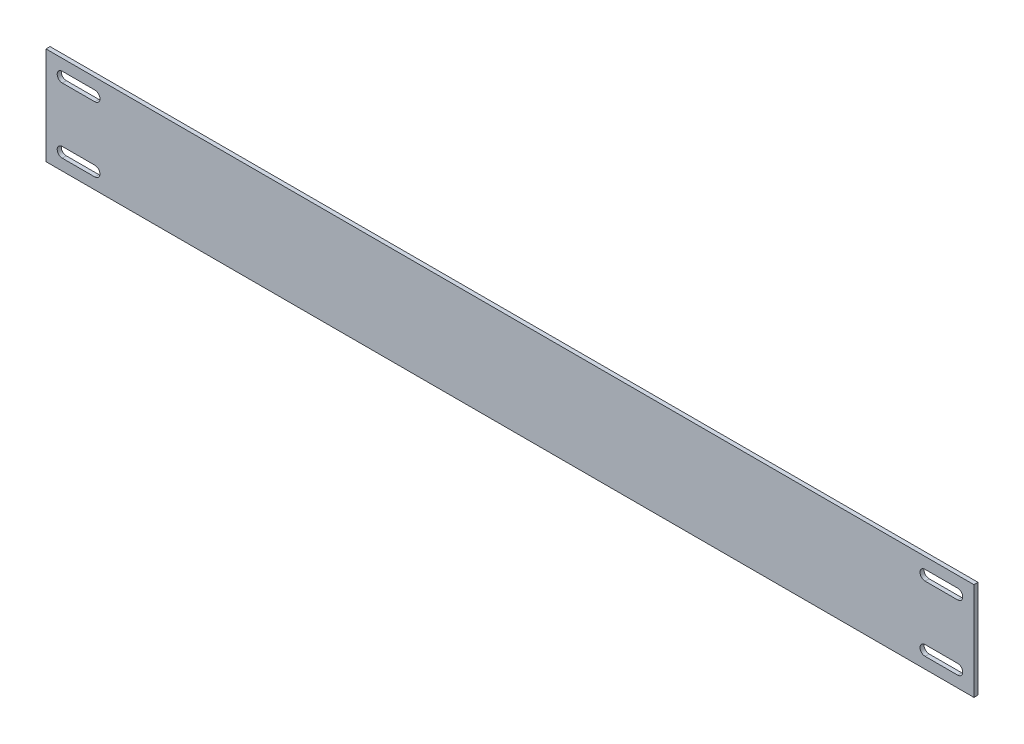
ISO-10303-21;
HEADER;
FILE_DESCRIPTION(('STEP AP214'),'2;1');
FILE_NAME('part.step','',(''),(''),'','','');
FILE_SCHEMA(('AUTOMOTIVE_DESIGN { 1 0 10303 214 1 1 1 1 }'));
ENDSEC;
DATA;
#1=APPLICATION_CONTEXT('core data for automotive mechanical design processes');
#2=APPLICATION_PROTOCOL_DEFINITION('international standard','automotive_design',2000,#1);
#3=PRODUCT_CONTEXT('',#1,'mechanical');
#4=PRODUCT('Part','Part','',(#3));
#5=PRODUCT_RELATED_PRODUCT_CATEGORY('part','',(#4));
#6=PRODUCT_DEFINITION_FORMATION('','',#4);
#7=PRODUCT_DEFINITION_CONTEXT('part definition',#1,'design');
#8=PRODUCT_DEFINITION('design','',#6,#7);
#9=PRODUCT_DEFINITION_SHAPE('','',#8);
#10=(LENGTH_UNIT() NAMED_UNIT(*) SI_UNIT(.MILLI.,.METRE.));
#11=(NAMED_UNIT(*) PLANE_ANGLE_UNIT() SI_UNIT($,.RADIAN.));
#12=(NAMED_UNIT(*) SI_UNIT($,.STERADIAN.) SOLID_ANGLE_UNIT());
#13=UNCERTAINTY_MEASURE_WITH_UNIT(LENGTH_MEASURE(1.E-05),#10,'distance_accuracy_value','');
#14=(GEOMETRIC_REPRESENTATION_CONTEXT(3) GLOBAL_UNCERTAINTY_ASSIGNED_CONTEXT((#13)) GLOBAL_UNIT_ASSIGNED_CONTEXT((#10,
#11,#12)) REPRESENTATION_CONTEXT('',''));
#15=CARTESIAN_POINT('',(0.,0.,0.));
#16=DIRECTION('',(0.,0.,1.));
#17=DIRECTION('',(1.,0.,0.));
#18=AXIS2_PLACEMENT_3D('',#15,#16,#17);
#19=CARTESIAN_POINT('',(0.,38.1,0.));
#20=DIRECTION('',(0.,0.,-1.));
#21=DIRECTION('',(-1.,0.,0.));
#22=AXIS2_PLACEMENT_3D('',#19,#20,#21);
#23=PLANE('',#22);
#24=CARTESIAN_POINT('',(342.9,6.35000000000005,0.));
#25=DIRECTION('',(0.,0.,-1.));
#26=DIRECTION('',(-1.,0.,0.));
#27=AXIS2_PLACEMENT_3D('',#24,#25,#26);
#28=CIRCLE('',#27,1.9843749999999);
#29=CARTESIAN_POINT('',(342.9,4.36562500000015,0.));
#30=VERTEX_POINT('',#29);
#31=CARTESIAN_POINT('',(342.9,8.33437499999994,0.));
#32=VERTEX_POINT('',#31);
#33=EDGE_CURVE('E232',#30,#32,#28,.T.);
#34=ORIENTED_EDGE('',*,*,#33,.T.);
#35=DIRECTION('',(1.,0.,0.));
#36=VECTOR('',#35,1.);
#37=CARTESIAN_POINT('',(0.,8.33437499999985,0.));
#38=LINE('',#37,#36);
#39=CARTESIAN_POINT('',(355.6,8.33437499999995,0.));
#40=VERTEX_POINT('',#39);
#41=EDGE_CURVE('E240',#32,#40,#38,.T.);
#42=ORIENTED_EDGE('',*,*,#41,.T.);
#43=CARTESIAN_POINT('',(355.6,6.35000000000005,0.));
#44=DIRECTION('',(0.,0.,-1.));
#45=DIRECTION('',(-1.,0.,0.));
#46=AXIS2_PLACEMENT_3D('',#43,#44,#45);
#47=CIRCLE('',#46,1.9843749999999);
#48=CARTESIAN_POINT('',(355.6,4.36562500000015,0.));
#49=VERTEX_POINT('',#48);
#50=EDGE_CURVE('E254',#40,#49,#47,.T.);
#51=ORIENTED_EDGE('',*,*,#50,.T.);
#52=DIRECTION('',(1.,0.,0.));
#53=VECTOR('',#52,1.);
#54=CARTESIAN_POINT('',(0.,4.36562500000015,0.));
#55=LINE('',#54,#53);
#56=EDGE_CURVE('E251',#30,#49,#55,.T.);
#57=ORIENTED_EDGE('',*,*,#56,.F.);
#58=EDGE_LOOP('',(#34,#42,#51,#57));
#59=FACE_BOUND('',#58,.T.);
#60=DIRECTION('',(1.,0.,0.));
#61=VECTOR('',#60,1.);
#62=CARTESIAN_POINT('',(0.,0.,0.));
#63=LINE('',#62,#61);
#64=CARTESIAN_POINT('',(0.,0.,0.));
#65=VERTEX_POINT('',#64);
#66=CARTESIAN_POINT('',(361.95,0.,0.));
#67=VERTEX_POINT('',#66);
#68=EDGE_CURVE('E335',#65,#67,#63,.T.);
#69=ORIENTED_EDGE('',*,*,#68,.T.);
#70=DIRECTION('',(0.,-1.,0.));
#71=VECTOR('',#70,1.);
#72=CARTESIAN_POINT('',(361.95,38.1,0.));
#73=LINE('',#72,#71);
#74=CARTESIAN_POINT('',(361.95,38.1,0.));
#75=VERTEX_POINT('',#74);
#76=EDGE_CURVE('E66',#75,#67,#73,.T.);
#77=ORIENTED_EDGE('',*,*,#76,.F.);
#78=DIRECTION('',(1.,0.,0.));
#79=VECTOR('',#78,1.);
#80=CARTESIAN_POINT('',(0.,38.1,0.));
#81=LINE('',#80,#79);
#82=CARTESIAN_POINT('',(0.,38.1,0.));
#83=VERTEX_POINT('',#82);
#84=EDGE_CURVE('E325',#83,#75,#81,.T.);
#85=ORIENTED_EDGE('',*,*,#84,.F.);
#86=DIRECTION('',(0.,-1.,0.));
#87=VECTOR('',#86,1.);
#88=CARTESIAN_POINT('',(0.,38.1,0.));
#89=LINE('',#88,#87);
#90=EDGE_CURVE('E12',#83,#65,#89,.T.);
#91=ORIENTED_EDGE('',*,*,#90,.T.);
#92=EDGE_LOOP('',(#69,#77,#85,#91));
#93=FACE_BOUND('',#92,.T.);
#94=CARTESIAN_POINT('',(19.05,31.75,0.));
#95=DIRECTION('',(0.,0.,-1.));
#96=DIRECTION('',(-1.,0.,0.));
#97=AXIS2_PLACEMENT_3D('',#94,#95,#96);
#98=CIRCLE('',#97,1.9843749999999);
#99=CARTESIAN_POINT('',(19.05,33.7343749999999,0.));
#100=VERTEX_POINT('',#99);
#101=CARTESIAN_POINT('',(19.05,29.7656250000001,0.));
#102=VERTEX_POINT('',#101);
#103=EDGE_CURVE('E300',#100,#102,#98,.T.);
#104=ORIENTED_EDGE('',*,*,#103,.T.);
#105=DIRECTION('',(-1.,0.,0.));
#106=VECTOR('',#105,1.);
#107=CARTESIAN_POINT('',(0.,29.7656250000001,0.));
#108=LINE('',#107,#106);
#109=CARTESIAN_POINT('',(6.35000000000003,29.7656250000001,0.));
#110=VERTEX_POINT('',#109);
#111=EDGE_CURVE('E290',#102,#110,#108,.T.);
#112=ORIENTED_EDGE('',*,*,#111,.T.);
#113=CARTESIAN_POINT('',(6.35000000000004,31.75,0.));
#114=DIRECTION('',(0.,0.,-1.));
#115=DIRECTION('',(-1.,0.,0.));
#116=AXIS2_PLACEMENT_3D('',#113,#114,#115);
#117=CIRCLE('',#116,1.9843749999999);
#118=CARTESIAN_POINT('',(6.35000000000002,33.7343749999999,0.));
#119=VERTEX_POINT('',#118);
#120=EDGE_CURVE('E293',#110,#119,#117,.T.);
#121=ORIENTED_EDGE('',*,*,#120,.T.);
#122=DIRECTION('',(-1.,0.,0.));
#123=VECTOR('',#122,1.);
#124=CARTESIAN_POINT('',(0.,33.7343749999999,0.));
#125=LINE('',#124,#123);
#126=EDGE_CURVE('E297',#100,#119,#125,.T.);
#127=ORIENTED_EDGE('',*,*,#126,.F.);
#128=EDGE_LOOP('',(#104,#112,#121,#127));
#129=FACE_BOUND('',#128,.T.);
#130=CARTESIAN_POINT('',(6.35000000000004,6.35000000000002,0.));
#131=DIRECTION('',(0.,0.,-1.));
#132=DIRECTION('',(-1.,0.,0.));
#133=AXIS2_PLACEMENT_3D('',#130,#131,#132);
#134=CIRCLE('',#133,1.9843749999999);
#135=CARTESIAN_POINT('',(6.35000000000002,8.33437499999992,0.));
#136=VERTEX_POINT('',#135);
#137=CARTESIAN_POINT('',(6.35000000000002,4.36562500000012,0.));
#138=VERTEX_POINT('',#137);
#139=EDGE_CURVE('E272',#136,#138,#134,.F.);
#140=ORIENTED_EDGE('',*,*,#139,.F.);
#141=DIRECTION('',(-1.,0.,0.));
#142=VECTOR('',#141,1.);
#143=CARTESIAN_POINT('',(0.,8.33437499999992,0.));
#144=LINE('',#143,#142);
#145=CARTESIAN_POINT('',(19.05,8.33437499999992,0.));
#146=VERTEX_POINT('',#145);
#147=EDGE_CURVE('E287',#146,#136,#144,.T.);
#148=ORIENTED_EDGE('',*,*,#147,.F.);
#149=CARTESIAN_POINT('',(19.05,6.35000000000002,0.));
#150=DIRECTION('',(0.,0.,-1.));
#151=DIRECTION('',(-1.,0.,0.));
#152=AXIS2_PLACEMENT_3D('',#149,#150,#151);
#153=CIRCLE('',#152,1.9843749999999);
#154=CARTESIAN_POINT('',(19.05,4.36562500000012,0.));
#155=VERTEX_POINT('',#154);
#156=EDGE_CURVE('E284',#155,#146,#153,.F.);
#157=ORIENTED_EDGE('',*,*,#156,.F.);
#158=DIRECTION('',(-1.,0.,0.));
#159=VECTOR('',#158,1.);
#160=CARTESIAN_POINT('',(0.,4.36562500000012,0.));
#161=LINE('',#160,#159);
#162=EDGE_CURVE('E262',#155,#138,#161,.T.);
#163=ORIENTED_EDGE('',*,*,#162,.T.);
#164=EDGE_LOOP('',(#140,#148,#157,#163));
#165=FACE_BOUND('',#164,.T.);
#166=CARTESIAN_POINT('',(342.9,31.75,0.));
#167=DIRECTION('',(0.,0.,-1.));
#168=DIRECTION('',(-1.,0.,0.));
#169=AXIS2_PLACEMENT_3D('',#166,#167,#168);
#170=CIRCLE('',#169,1.9843749999999);
#171=CARTESIAN_POINT('',(342.9,33.7343749999998,0.));
#172=VERTEX_POINT('',#171);
#173=CARTESIAN_POINT('',(342.9,29.7656250000001,0.));
#174=VERTEX_POINT('',#173);
#175=EDGE_CURVE('E223',#172,#174,#170,.F.);
#176=ORIENTED_EDGE('',*,*,#175,.F.);
#177=DIRECTION('',(1.,0.,0.));
#178=VECTOR('',#177,1.);
#179=CARTESIAN_POINT('',(0.,33.7343749999999,0.));
#180=LINE('',#179,#178);
#181=CARTESIAN_POINT('',(355.6,33.7343749999999,0.));
#182=VERTEX_POINT('',#181);
#183=EDGE_CURVE('E73',#172,#182,#180,.T.);
#184=ORIENTED_EDGE('',*,*,#183,.T.);
#185=CARTESIAN_POINT('',(355.6,31.75,0.));
#186=DIRECTION('',(0.,0.,-1.));
#187=DIRECTION('',(-1.,0.,0.));
#188=AXIS2_PLACEMENT_3D('',#185,#186,#187);
#189=CIRCLE('',#188,1.9843749999999);
#190=CARTESIAN_POINT('',(355.6,29.7656250000001,0.));
#191=VERTEX_POINT('',#190);
#192=EDGE_CURVE('E203',#191,#182,#189,.F.);
#193=ORIENTED_EDGE('',*,*,#192,.F.);
#194=DIRECTION('',(1.,0.,0.));
#195=VECTOR('',#194,1.);
#196=CARTESIAN_POINT('',(0.,29.7656250000002,0.));
#197=LINE('',#196,#195);
#198=EDGE_CURVE('E226',#174,#191,#197,.T.);
#199=ORIENTED_EDGE('',*,*,#198,.F.);
#200=EDGE_LOOP('',(#176,#184,#193,#199));
#201=FACE_BOUND('',#200,.T.);
#202=ADVANCED_FACE('F58',(#59,#93,#129,#165,#201),#23,.F.);
#203=CARTESIAN_POINT('',(0.,38.1,-1.5875));
#204=DIRECTION('',(0.,0.,1.));
#205=DIRECTION('',(1.,0.,0.));
#206=AXIS2_PLACEMENT_3D('',#203,#204,#205);
#207=PLANE('',#206);
#208=CARTESIAN_POINT('',(355.6,6.35000000000005,-1.5875));
#209=DIRECTION('',(0.,0.,-1.));
#210=DIRECTION('',(-1.,0.,0.));
#211=AXIS2_PLACEMENT_3D('',#208,#209,#210);
#212=CIRCLE('',#211,1.9843749999999);
#213=CARTESIAN_POINT('',(355.6,8.33437499999995,-1.5875));
#214=VERTEX_POINT('',#213);
#215=CARTESIAN_POINT('',(355.6,4.36562500000015,-1.5875));
#216=VERTEX_POINT('',#215);
#217=EDGE_CURVE('E243',#214,#216,#212,.T.);
#218=ORIENTED_EDGE('',*,*,#217,.F.);
#219=DIRECTION('',(1.,0.,0.));
#220=VECTOR('',#219,1.);
#221=CARTESIAN_POINT('',(0.,8.33437499999985,-1.5875));
#222=LINE('',#221,#220);
#223=CARTESIAN_POINT('',(342.9,8.33437499999994,-1.5875));
#224=VERTEX_POINT('',#223);
#225=EDGE_CURVE('E246',#224,#214,#222,.T.);
#226=ORIENTED_EDGE('',*,*,#225,.F.);
#227=CARTESIAN_POINT('',(342.9,6.35000000000005,-1.5875));
#228=DIRECTION('',(0.,0.,-1.));
#229=DIRECTION('',(-1.,0.,0.));
#230=AXIS2_PLACEMENT_3D('',#227,#228,#229);
#231=CIRCLE('',#230,1.9843749999999);
#232=CARTESIAN_POINT('',(342.9,4.36562500000015,-1.5875));
#233=VERTEX_POINT('',#232);
#234=EDGE_CURVE('E236',#233,#224,#231,.T.);
#235=ORIENTED_EDGE('',*,*,#234,.F.);
#236=DIRECTION('',(1.,0.,0.));
#237=VECTOR('',#236,1.);
#238=CARTESIAN_POINT('',(0.,4.36562500000015,-1.5875));
#239=LINE('',#238,#237);
#240=EDGE_CURVE('E239',#233,#216,#239,.T.);
#241=ORIENTED_EDGE('',*,*,#240,.T.);
#242=EDGE_LOOP('',(#218,#226,#235,#241));
#243=FACE_BOUND('',#242,.T.);
#244=DIRECTION('',(-1.,0.,0.));
#245=VECTOR('',#244,1.);
#246=CARTESIAN_POINT('',(0.,0.,-1.5875));
#247=LINE('',#246,#245);
#248=CARTESIAN_POINT('',(361.95,0.,-1.5875));
#249=VERTEX_POINT('',#248);
#250=CARTESIAN_POINT('',(0.,0.,-1.5875));
#251=VERTEX_POINT('',#250);
#252=EDGE_CURVE('E326',#249,#251,#247,.T.);
#253=ORIENTED_EDGE('',*,*,#252,.T.);
#254=DIRECTION('',(0.,-1.,0.));
#255=VECTOR('',#254,1.);
#256=CARTESIAN_POINT('',(0.,38.1,-1.5875));
#257=LINE('',#256,#255);
#258=CARTESIAN_POINT('',(0.,38.1,-1.5875));
#259=VERTEX_POINT('',#258);
#260=EDGE_CURVE('E332',#259,#251,#257,.T.);
#261=ORIENTED_EDGE('',*,*,#260,.F.);
#262=DIRECTION('',(-1.,0.,0.));
#263=VECTOR('',#262,1.);
#264=CARTESIAN_POINT('',(361.95,38.1,-1.5875));
#265=LINE('',#264,#263);
#266=CARTESIAN_POINT('',(361.95,38.1,-1.5875));
#267=VERTEX_POINT('',#266);
#268=EDGE_CURVE('E330',#267,#259,#265,.T.);
#269=ORIENTED_EDGE('',*,*,#268,.F.);
#270=DIRECTION('',(0.,-1.,0.));
#271=VECTOR('',#270,1.);
#272=CARTESIAN_POINT('',(361.95,38.1,-1.5875));
#273=LINE('',#272,#271);
#274=EDGE_CURVE('E343',#267,#249,#273,.T.);
#275=ORIENTED_EDGE('',*,*,#274,.T.);
#276=EDGE_LOOP('',(#253,#261,#269,#275));
#277=FACE_BOUND('',#276,.T.);
#278=CARTESIAN_POINT('',(6.35000000000004,31.75,-1.5875));
#279=DIRECTION('',(0.,0.,-1.));
#280=DIRECTION('',(-1.,0.,0.));
#281=AXIS2_PLACEMENT_3D('',#278,#279,#280);
#282=CIRCLE('',#281,1.9843749999999);
#283=CARTESIAN_POINT('',(6.35000000000003,29.7656250000001,-1.5875));
#284=VERTEX_POINT('',#283);
#285=CARTESIAN_POINT('',(6.35000000000002,33.7343749999999,-1.5875));
#286=VERTEX_POINT('',#285);
#287=EDGE_CURVE('E305',#284,#286,#282,.T.);
#288=ORIENTED_EDGE('',*,*,#287,.F.);
#289=DIRECTION('',(-1.,0.,0.));
#290=VECTOR('',#289,1.);
#291=CARTESIAN_POINT('',(0.,29.7656250000001,-1.5875));
#292=LINE('',#291,#290);
#293=CARTESIAN_POINT('',(19.05,29.7656250000001,-1.5875));
#294=VERTEX_POINT('',#293);
#295=EDGE_CURVE('E281',#294,#284,#292,.T.);
#296=ORIENTED_EDGE('',*,*,#295,.F.);
#297=CARTESIAN_POINT('',(19.05,31.75,-1.5875));
#298=DIRECTION('',(0.,0.,-1.));
#299=DIRECTION('',(-1.,0.,0.));
#300=AXIS2_PLACEMENT_3D('',#297,#298,#299);
#301=CIRCLE('',#300,1.9843749999999);
#302=CARTESIAN_POINT('',(19.05,33.7343749999999,-1.5875));
#303=VERTEX_POINT('',#302);
#304=EDGE_CURVE('E294',#303,#294,#301,.T.);
#305=ORIENTED_EDGE('',*,*,#304,.F.);
#306=DIRECTION('',(-1.,0.,0.));
#307=VECTOR('',#306,1.);
#308=CARTESIAN_POINT('',(0.,33.7343749999999,-1.5875));
#309=LINE('',#308,#307);
#310=EDGE_CURVE('E308',#303,#286,#309,.T.);
#311=ORIENTED_EDGE('',*,*,#310,.T.);
#312=EDGE_LOOP('',(#288,#296,#305,#311));
#313=FACE_BOUND('',#312,.T.);
#314=CARTESIAN_POINT('',(6.35000000000004,6.35000000000002,-1.5875));
#315=DIRECTION('',(0.,0.,-1.));
#316=DIRECTION('',(-1.,0.,0.));
#317=AXIS2_PLACEMENT_3D('',#314,#315,#316);
#318=CIRCLE('',#317,1.9843749999999);
#319=CARTESIAN_POINT('',(6.35000000000002,8.33437499999992,-1.5875));
#320=VERTEX_POINT('',#319);
#321=CARTESIAN_POINT('',(6.35000000000002,4.36562500000012,-1.5875));
#322=VERTEX_POINT('',#321);
#323=EDGE_CURVE('E278',#320,#322,#318,.F.);
#324=ORIENTED_EDGE('',*,*,#323,.T.);
#325=DIRECTION('',(-1.,0.,0.));
#326=VECTOR('',#325,1.);
#327=CARTESIAN_POINT('',(0.,4.36562500000012,-1.5875));
#328=LINE('',#327,#326);
#329=CARTESIAN_POINT('',(19.05,4.36562500000012,-1.5875));
#330=VERTEX_POINT('',#329);
#331=EDGE_CURVE('E268',#330,#322,#328,.T.);
#332=ORIENTED_EDGE('',*,*,#331,.F.);
#333=CARTESIAN_POINT('',(19.05,6.35000000000002,-1.5875));
#334=DIRECTION('',(0.,0.,-1.));
#335=DIRECTION('',(-1.,0.,0.));
#336=AXIS2_PLACEMENT_3D('',#333,#334,#335);
#337=CIRCLE('',#336,1.9843749999999);
#338=CARTESIAN_POINT('',(19.05,8.33437499999992,-1.5875));
#339=VERTEX_POINT('',#338);
#340=EDGE_CURVE('E271',#330,#339,#337,.F.);
#341=ORIENTED_EDGE('',*,*,#340,.T.);
#342=DIRECTION('',(-1.,0.,0.));
#343=VECTOR('',#342,1.);
#344=CARTESIAN_POINT('',(0.,8.33437499999992,-1.5875));
#345=LINE('',#344,#343);
#346=EDGE_CURVE('E275',#339,#320,#345,.T.);
#347=ORIENTED_EDGE('',*,*,#346,.T.);
#348=EDGE_LOOP('',(#324,#332,#341,#347));
#349=FACE_BOUND('',#348,.T.);
#350=CARTESIAN_POINT('',(355.6,31.75,-1.5875));
#351=DIRECTION('',(0.,0.,-1.));
#352=DIRECTION('',(-1.,0.,0.));
#353=AXIS2_PLACEMENT_3D('',#350,#351,#352);
#354=CIRCLE('',#353,1.9843749999999);
#355=CARTESIAN_POINT('',(355.6,29.7656250000001,-1.5875));
#356=VERTEX_POINT('',#355);
#357=CARTESIAN_POINT('',(355.6,33.7343749999999,-1.5875));
#358=VERTEX_POINT('',#357);
#359=EDGE_CURVE('E201',#356,#358,#354,.F.);
#360=ORIENTED_EDGE('',*,*,#359,.T.);
#361=DIRECTION('',(1.,0.,0.));
#362=VECTOR('',#361,1.);
#363=CARTESIAN_POINT('',(0.,33.7343749999999,-1.5875));
#364=LINE('',#363,#362);
#365=CARTESIAN_POINT('',(342.9,33.7343749999999,-1.5875));
#366=VERTEX_POINT('',#365);
#367=EDGE_CURVE('E207',#366,#358,#364,.T.);
#368=ORIENTED_EDGE('',*,*,#367,.F.);
#369=CARTESIAN_POINT('',(342.9,31.75,-1.5875));
#370=DIRECTION('',(0.,0.,-1.));
#371=DIRECTION('',(-1.,0.,0.));
#372=AXIS2_PLACEMENT_3D('',#369,#370,#371);
#373=CIRCLE('',#372,1.9843749999999);
#374=CARTESIAN_POINT('',(342.9,29.7656250000001,-1.5875));
#375=VERTEX_POINT('',#374);
#376=EDGE_CURVE('E212',#366,#375,#373,.F.);
#377=ORIENTED_EDGE('',*,*,#376,.T.);
#378=DIRECTION('',(1.,0.,0.));
#379=VECTOR('',#378,1.);
#380=CARTESIAN_POINT('',(0.,29.7656250000002,-1.5875));
#381=LINE('',#380,#379);
#382=EDGE_CURVE('E81',#375,#356,#381,.T.);
#383=ORIENTED_EDGE('',*,*,#382,.T.);
#384=EDGE_LOOP('',(#360,#368,#377,#383));
#385=FACE_BOUND('',#384,.T.);
#386=ADVANCED_FACE('F214',(#243,#277,#313,#349,#385),#207,.F.);
#387=CARTESIAN_POINT('',(0.,38.1,0.));
#388=DIRECTION('',(1.,0.,0.));
#389=DIRECTION('',(0.,0.,-1.));
#390=AXIS2_PLACEMENT_3D('',#387,#388,#389);
#391=PLANE('',#390);
#392=DIRECTION('',(0.,0.,1.));
#393=VECTOR('',#392,1.);
#394=CARTESIAN_POINT('',(0.,0.,0.));
#395=LINE('',#394,#393);
#396=EDGE_CURVE('E315',#251,#65,#395,.T.);
#397=ORIENTED_EDGE('',*,*,#396,.T.);
#398=ORIENTED_EDGE('',*,*,#90,.F.);
#399=DIRECTION('',(0.,0.,1.));
#400=VECTOR('',#399,1.);
#401=CARTESIAN_POINT('',(0.,38.1,0.));
#402=LINE('',#401,#400);
#403=EDGE_CURVE('E322',#259,#83,#402,.T.);
#404=ORIENTED_EDGE('',*,*,#403,.F.);
#405=ORIENTED_EDGE('',*,*,#260,.T.);
#406=EDGE_LOOP('',(#397,#398,#404,#405));
#407=FACE_BOUND('',#406,.T.);
#408=ADVANCED_FACE('F60',(#407),#391,.F.);
#409=CARTESIAN_POINT('',(361.95,38.1,0.));
#410=DIRECTION('',(-1.,0.,0.));
#411=DIRECTION('',(0.,0.,1.));
#412=AXIS2_PLACEMENT_3D('',#409,#410,#411);
#413=PLANE('',#412);
#414=DIRECTION('',(0.,0.,-1.));
#415=VECTOR('',#414,1.);
#416=CARTESIAN_POINT('',(361.95,0.,0.));
#417=LINE('',#416,#415);
#418=EDGE_CURVE('E337',#67,#249,#417,.T.);
#419=ORIENTED_EDGE('',*,*,#418,.T.);
#420=ORIENTED_EDGE('',*,*,#274,.F.);
#421=DIRECTION('',(0.,0.,-1.));
#422=VECTOR('',#421,1.);
#423=CARTESIAN_POINT('',(361.95,38.1,0.));
#424=LINE('',#423,#422);
#425=EDGE_CURVE('E328',#75,#267,#424,.T.);
#426=ORIENTED_EDGE('',*,*,#425,.F.);
#427=ORIENTED_EDGE('',*,*,#76,.T.);
#428=EDGE_LOOP('',(#419,#420,#426,#427));
#429=FACE_BOUND('',#428,.T.);
#430=ADVANCED_FACE('F350',(#429),#413,.F.);
#431=CARTESIAN_POINT('',(0.,38.1,0.));
#432=DIRECTION('',(0.,-1.,0.));
#433=DIRECTION('',(0.,0.,-1.));
#434=AXIS2_PLACEMENT_3D('',#431,#432,#433);
#435=PLANE('',#434);
#436=ORIENTED_EDGE('',*,*,#403,.T.);
#437=ORIENTED_EDGE('',*,*,#84,.T.);
#438=ORIENTED_EDGE('',*,*,#425,.T.);
#439=ORIENTED_EDGE('',*,*,#268,.T.);
#440=EDGE_LOOP('',(#436,#437,#438,#439));
#441=FACE_BOUND('',#440,.T.);
#442=ADVANCED_FACE('F364',(#441),#435,.F.);
#443=CARTESIAN_POINT('',(0.,0.,0.));
#444=DIRECTION('',(0.,-1.,0.));
#445=DIRECTION('',(0.,0.,-1.));
#446=AXIS2_PLACEMENT_3D('',#443,#444,#445);
#447=PLANE('',#446);
#448=ORIENTED_EDGE('',*,*,#396,.F.);
#449=ORIENTED_EDGE('',*,*,#252,.F.);
#450=ORIENTED_EDGE('',*,*,#418,.F.);
#451=ORIENTED_EDGE('',*,*,#68,.F.);
#452=EDGE_LOOP('',(#448,#449,#450,#451));
#453=FACE_BOUND('',#452,.T.);
#454=ADVANCED_FACE('F355',(#453),#447,.T.);
#455=CARTESIAN_POINT('',(0.,29.7656250000001,0.));
#456=DIRECTION('',(0.,-1.,0.));
#457=DIRECTION('',(0.,0.,-1.));
#458=AXIS2_PLACEMENT_3D('',#455,#456,#457);
#459=PLANE('',#458);
#460=ORIENTED_EDGE('',*,*,#295,.T.);
#461=DIRECTION('',(0.,0.,-1.));
#462=VECTOR('',#461,1.);
#463=CARTESIAN_POINT('',(6.35000000000003,29.7656250000001,0.));
#464=LINE('',#463,#462);
#465=EDGE_CURVE('E303',#110,#284,#464,.T.);
#466=ORIENTED_EDGE('',*,*,#465,.F.);
#467=ORIENTED_EDGE('',*,*,#111,.F.);
#468=DIRECTION('',(0.,0.,-1.));
#469=VECTOR('',#468,1.);
#470=CARTESIAN_POINT('',(19.05,29.7656250000001,0.));
#471=LINE('',#470,#469);
#472=EDGE_CURVE('E313',#102,#294,#471,.T.);
#473=ORIENTED_EDGE('',*,*,#472,.T.);
#474=EDGE_LOOP('',(#460,#466,#467,#473));
#475=FACE_BOUND('',#474,.T.);
#476=ADVANCED_FACE('F431',(#475),#459,.F.);
#477=CARTESIAN_POINT('',(19.05,31.75,0.));
#478=DIRECTION('',(0.,0.,-1.));
#479=DIRECTION('',(-1.,0.,0.));
#480=AXIS2_PLACEMENT_3D('',#477,#478,#479);
#481=CYLINDRICAL_SURFACE('',#480,1.9843749999999);
#482=ORIENTED_EDGE('',*,*,#304,.T.);
#483=ORIENTED_EDGE('',*,*,#472,.F.);
#484=ORIENTED_EDGE('',*,*,#103,.F.);
#485=DIRECTION('',(0.,0.,-1.));
#486=VECTOR('',#485,1.);
#487=CARTESIAN_POINT('',(19.05,33.7343749999999,0.));
#488=LINE('',#487,#486);
#489=EDGE_CURVE('E316',#100,#303,#488,.T.);
#490=ORIENTED_EDGE('',*,*,#489,.T.);
#491=EDGE_LOOP('',(#482,#483,#484,#490));
#492=FACE_BOUND('',#491,.T.);
#493=ADVANCED_FACE('F427',(#492),#481,.F.);
#494=CARTESIAN_POINT('',(0.,33.7343749999999,0.));
#495=DIRECTION('',(0.,-1.,0.));
#496=DIRECTION('',(0.,0.,-1.));
#497=AXIS2_PLACEMENT_3D('',#494,#495,#496);
#498=PLANE('',#497);
#499=ORIENTED_EDGE('',*,*,#310,.F.);
#500=ORIENTED_EDGE('',*,*,#489,.F.);
#501=ORIENTED_EDGE('',*,*,#126,.T.);
#502=DIRECTION('',(0.,0.,-1.));
#503=VECTOR('',#502,1.);
#504=CARTESIAN_POINT('',(6.35000000000002,33.7343749999999,0.));
#505=LINE('',#504,#503);
#506=EDGE_CURVE('E318',#119,#286,#505,.T.);
#507=ORIENTED_EDGE('',*,*,#506,.T.);
#508=EDGE_LOOP('',(#499,#500,#501,#507));
#509=FACE_BOUND('',#508,.T.);
#510=ADVANCED_FACE('F430',(#509),#498,.T.);
#511=CARTESIAN_POINT('',(6.35000000000004,31.75,0.));
#512=DIRECTION('',(0.,0.,-1.));
#513=DIRECTION('',(-1.,0.,0.));
#514=AXIS2_PLACEMENT_3D('',#511,#512,#513);
#515=CYLINDRICAL_SURFACE('',#514,1.9843749999999);
#516=ORIENTED_EDGE('',*,*,#287,.T.);
#517=ORIENTED_EDGE('',*,*,#506,.F.);
#518=ORIENTED_EDGE('',*,*,#120,.F.);
#519=ORIENTED_EDGE('',*,*,#465,.T.);
#520=EDGE_LOOP('',(#516,#517,#518,#519));
#521=FACE_BOUND('',#520,.T.);
#522=ADVANCED_FACE('F415',(#521),#515,.F.);
#523=CARTESIAN_POINT('',(6.35000000000004,6.35000000000002,0.));
#524=DIRECTION('',(0.,0.,-1.));
#525=DIRECTION('',(-1.,0.,0.));
#526=AXIS2_PLACEMENT_3D('',#523,#524,#525);
#527=CYLINDRICAL_SURFACE('',#526,1.9843749999999);
#528=ORIENTED_EDGE('',*,*,#323,.F.);
#529=DIRECTION('',(0.,0.,-1.));
#530=VECTOR('',#529,1.);
#531=CARTESIAN_POINT('',(6.35000000000002,8.33437499999992,0.));
#532=LINE('',#531,#530);
#533=EDGE_CURVE('E259',#136,#320,#532,.T.);
#534=ORIENTED_EDGE('',*,*,#533,.F.);
#535=ORIENTED_EDGE('',*,*,#139,.T.);
#536=DIRECTION('',(0.,0.,-1.));
#537=VECTOR('',#536,1.);
#538=CARTESIAN_POINT('',(6.35000000000002,4.36562500000012,0.));
#539=LINE('',#538,#537);
#540=EDGE_CURVE('E248',#138,#322,#539,.T.);
#541=ORIENTED_EDGE('',*,*,#540,.T.);
#542=EDGE_LOOP('',(#528,#534,#535,#541));
#543=FACE_BOUND('',#542,.T.);
#544=ADVANCED_FACE('F411',(#543),#527,.F.);
#545=CARTESIAN_POINT('',(0.,4.36562500000012,0.));
#546=DIRECTION('',(0.,-1.,0.));
#547=DIRECTION('',(0.,0.,-1.));
#548=AXIS2_PLACEMENT_3D('',#545,#546,#547);
#549=PLANE('',#548);
#550=ORIENTED_EDGE('',*,*,#331,.T.);
#551=ORIENTED_EDGE('',*,*,#540,.F.);
#552=ORIENTED_EDGE('',*,*,#162,.F.);
#553=DIRECTION('',(0.,0.,-1.));
#554=VECTOR('',#553,1.);
#555=CARTESIAN_POINT('',(19.05,4.36562500000012,0.));
#556=LINE('',#555,#554);
#557=EDGE_CURVE('E265',#155,#330,#556,.T.);
#558=ORIENTED_EDGE('',*,*,#557,.T.);
#559=EDGE_LOOP('',(#550,#551,#552,#558));
#560=FACE_BOUND('',#559,.T.);
#561=ADVANCED_FACE('F414',(#560),#549,.F.);
#562=CARTESIAN_POINT('',(19.05,6.35000000000002,0.));
#563=DIRECTION('',(0.,0.,-1.));
#564=DIRECTION('',(-1.,0.,0.));
#565=AXIS2_PLACEMENT_3D('',#562,#563,#564);
#566=CYLINDRICAL_SURFACE('',#565,1.9843749999999);
#567=ORIENTED_EDGE('',*,*,#340,.F.);
#568=ORIENTED_EDGE('',*,*,#557,.F.);
#569=ORIENTED_EDGE('',*,*,#156,.T.);
#570=DIRECTION('',(0.,0.,-1.));
#571=VECTOR('',#570,1.);
#572=CARTESIAN_POINT('',(19.05,8.33437499999992,0.));
#573=LINE('',#572,#571);
#574=EDGE_CURVE('E263',#146,#339,#573,.T.);
#575=ORIENTED_EDGE('',*,*,#574,.T.);
#576=EDGE_LOOP('',(#567,#568,#569,#575));
#577=FACE_BOUND('',#576,.T.);
#578=ADVANCED_FACE('F419',(#577),#566,.F.);
#579=CARTESIAN_POINT('',(0.,8.33437499999992,0.));
#580=DIRECTION('',(0.,-1.,0.));
#581=DIRECTION('',(0.,0.,-1.));
#582=AXIS2_PLACEMENT_3D('',#579,#580,#581);
#583=PLANE('',#582);
#584=ORIENTED_EDGE('',*,*,#346,.F.);
#585=ORIENTED_EDGE('',*,*,#574,.F.);
#586=ORIENTED_EDGE('',*,*,#147,.T.);
#587=ORIENTED_EDGE('',*,*,#533,.T.);
#588=EDGE_LOOP('',(#584,#585,#586,#587));
#589=FACE_BOUND('',#588,.T.);
#590=ADVANCED_FACE('F399',(#589),#583,.T.);
#591=CARTESIAN_POINT('',(0.,8.33437499999985,0.));
#592=DIRECTION('',(0.,1.,0.));
#593=DIRECTION('',(-1.,0.,0.));
#594=AXIS2_PLACEMENT_3D('',#591,#592,#593);
#595=PLANE('',#594);
#596=ORIENTED_EDGE('',*,*,#225,.T.);
#597=DIRECTION('',(0.,0.,-1.));
#598=VECTOR('',#597,1.);
#599=CARTESIAN_POINT('',(355.6,8.33437499999995,0.));
#600=LINE('',#599,#598);
#601=EDGE_CURVE('E229',#40,#214,#600,.T.);
#602=ORIENTED_EDGE('',*,*,#601,.F.);
#603=ORIENTED_EDGE('',*,*,#41,.F.);
#604=DIRECTION('',(0.,0.,-1.));
#605=VECTOR('',#604,1.);
#606=CARTESIAN_POINT('',(342.9,8.33437499999994,0.));
#607=LINE('',#606,#605);
#608=EDGE_CURVE('E215',#32,#224,#607,.T.);
#609=ORIENTED_EDGE('',*,*,#608,.T.);
#610=EDGE_LOOP('',(#596,#602,#603,#609));
#611=FACE_BOUND('',#610,.T.);
#612=ADVANCED_FACE('F395',(#611),#595,.F.);
#613=CARTESIAN_POINT('',(342.9,6.35000000000005,0.));
#614=DIRECTION('',(0.,0.,-1.));
#615=DIRECTION('',(-1.,0.,0.));
#616=AXIS2_PLACEMENT_3D('',#613,#614,#615);
#617=CYLINDRICAL_SURFACE('',#616,1.9843749999999);
#618=ORIENTED_EDGE('',*,*,#234,.T.);
#619=ORIENTED_EDGE('',*,*,#608,.F.);
#620=ORIENTED_EDGE('',*,*,#33,.F.);
#621=DIRECTION('',(0.,0.,-1.));
#622=VECTOR('',#621,1.);
#623=CARTESIAN_POINT('',(342.9,4.36562500000015,0.));
#624=LINE('',#623,#622);
#625=EDGE_CURVE('E217',#30,#233,#624,.T.);
#626=ORIENTED_EDGE('',*,*,#625,.T.);
#627=EDGE_LOOP('',(#618,#619,#620,#626));
#628=FACE_BOUND('',#627,.T.);
#629=ADVANCED_FACE('F398',(#628),#617,.F.);
#630=CARTESIAN_POINT('',(0.,4.36562500000015,0.));
#631=DIRECTION('',(0.,1.,0.));
#632=DIRECTION('',(0.,0.,1.));
#633=AXIS2_PLACEMENT_3D('',#630,#631,#632);
#634=PLANE('',#633);
#635=ORIENTED_EDGE('',*,*,#240,.F.);
#636=ORIENTED_EDGE('',*,*,#625,.F.);
#637=ORIENTED_EDGE('',*,*,#56,.T.);
#638=DIRECTION('',(0.,0.,-1.));
#639=VECTOR('',#638,1.);
#640=CARTESIAN_POINT('',(355.6,4.36562500000015,0.));
#641=LINE('',#640,#639);
#642=EDGE_CURVE('E233',#49,#216,#641,.T.);
#643=ORIENTED_EDGE('',*,*,#642,.T.);
#644=EDGE_LOOP('',(#635,#636,#637,#643));
#645=FACE_BOUND('',#644,.T.);
#646=ADVANCED_FACE('F403',(#645),#634,.T.);
#647=CARTESIAN_POINT('',(355.6,6.35000000000005,0.));
#648=DIRECTION('',(0.,0.,-1.));
#649=DIRECTION('',(-1.,0.,0.));
#650=AXIS2_PLACEMENT_3D('',#647,#648,#649);
#651=CYLINDRICAL_SURFACE('',#650,1.9843749999999);
#652=ORIENTED_EDGE('',*,*,#217,.T.);
#653=ORIENTED_EDGE('',*,*,#642,.F.);
#654=ORIENTED_EDGE('',*,*,#50,.F.);
#655=ORIENTED_EDGE('',*,*,#601,.T.);
#656=EDGE_LOOP('',(#652,#653,#654,#655));
#657=FACE_BOUND('',#656,.T.);
#658=ADVANCED_FACE('F394',(#657),#651,.F.);
#659=CARTESIAN_POINT('',(0.,33.7343749999999,0.));
#660=DIRECTION('',(0.,1.,0.));
#661=DIRECTION('',(0.,0.,1.));
#662=AXIS2_PLACEMENT_3D('',#659,#660,#661);
#663=PLANE('',#662);
#664=ORIENTED_EDGE('',*,*,#367,.T.);
#665=DIRECTION('',(0.,0.,-1.));
#666=VECTOR('',#665,1.);
#667=CARTESIAN_POINT('',(355.6,33.7343749999999,0.));
#668=LINE('',#667,#666);
#669=EDGE_CURVE('E196',#182,#358,#668,.T.);
#670=ORIENTED_EDGE('',*,*,#669,.F.);
#671=ORIENTED_EDGE('',*,*,#183,.F.);
#672=DIRECTION('',(0.,0.,-1.));
#673=VECTOR('',#672,1.);
#674=CARTESIAN_POINT('',(342.9,33.7343749999999,0.));
#675=LINE('',#674,#673);
#676=EDGE_CURVE('E204',#172,#366,#675,.T.);
#677=ORIENTED_EDGE('',*,*,#676,.T.);
#678=EDGE_LOOP('',(#664,#670,#671,#677));
#679=FACE_BOUND('',#678,.T.);
#680=ADVANCED_FACE('F208',(#679),#663,.F.);
#681=CARTESIAN_POINT('',(355.6,31.75,0.));
#682=DIRECTION('',(0.,0.,-1.));
#683=DIRECTION('',(-1.,0.,0.));
#684=AXIS2_PLACEMENT_3D('',#681,#682,#683);
#685=CYLINDRICAL_SURFACE('',#684,1.9843749999999);
#686=ORIENTED_EDGE('',*,*,#359,.F.);
#687=DIRECTION('',(0.,0.,-1.));
#688=VECTOR('',#687,1.);
#689=CARTESIAN_POINT('',(355.6,29.7656250000001,0.));
#690=LINE('',#689,#688);
#691=EDGE_CURVE('E224',#191,#356,#690,.T.);
#692=ORIENTED_EDGE('',*,*,#691,.F.);
#693=ORIENTED_EDGE('',*,*,#192,.T.);
#694=ORIENTED_EDGE('',*,*,#669,.T.);
#695=EDGE_LOOP('',(#686,#692,#693,#694));
#696=FACE_BOUND('',#695,.T.);
#697=ADVANCED_FACE('F198',(#696),#685,.F.);
#698=CARTESIAN_POINT('',(0.,29.7656250000002,0.));
#699=DIRECTION('',(0.,1.,0.));
#700=DIRECTION('',(-1.,0.,0.));
#701=AXIS2_PLACEMENT_3D('',#698,#699,#700);
#702=PLANE('',#701);
#703=ORIENTED_EDGE('',*,*,#382,.F.);
#704=DIRECTION('',(0.,0.,-1.));
#705=VECTOR('',#704,1.);
#706=CARTESIAN_POINT('',(342.9,29.7656250000001,0.));
#707=LINE('',#706,#705);
#708=EDGE_CURVE('E378',#174,#375,#707,.T.);
#709=ORIENTED_EDGE('',*,*,#708,.F.);
#710=ORIENTED_EDGE('',*,*,#198,.T.);
#711=ORIENTED_EDGE('',*,*,#691,.T.);
#712=EDGE_LOOP('',(#703,#709,#710,#711));
#713=FACE_BOUND('',#712,.T.);
#714=ADVANCED_FACE('F379',(#713),#702,.T.);
#715=CARTESIAN_POINT('',(342.9,31.75,0.));
#716=DIRECTION('',(0.,0.,-1.));
#717=DIRECTION('',(-1.,0.,0.));
#718=AXIS2_PLACEMENT_3D('',#715,#716,#717);
#719=CYLINDRICAL_SURFACE('',#718,1.9843749999999);
#720=ORIENTED_EDGE('',*,*,#376,.F.);
#721=ORIENTED_EDGE('',*,*,#676,.F.);
#722=ORIENTED_EDGE('',*,*,#175,.T.);
#723=ORIENTED_EDGE('',*,*,#708,.T.);
#724=EDGE_LOOP('',(#720,#721,#722,#723));
#725=FACE_BOUND('',#724,.T.);
#726=ADVANCED_FACE('F377',(#725),#719,.F.);
#727=CLOSED_SHELL('',(#202,#386,#408,#430,#442,#454,#476,#493,#510,#522,#544,#561,#578,#590,
#612,#629,#646,#658,#680,#697,#714,#726));
#728=MANIFOLD_SOLID_BREP('B2',#727);
#729=ADVANCED_BREP_SHAPE_REPRESENTATION('',(#18,#728),#14);
#730=SHAPE_DEFINITION_REPRESENTATION(#9,#729);
ENDSEC;
END-ISO-10303-21;
